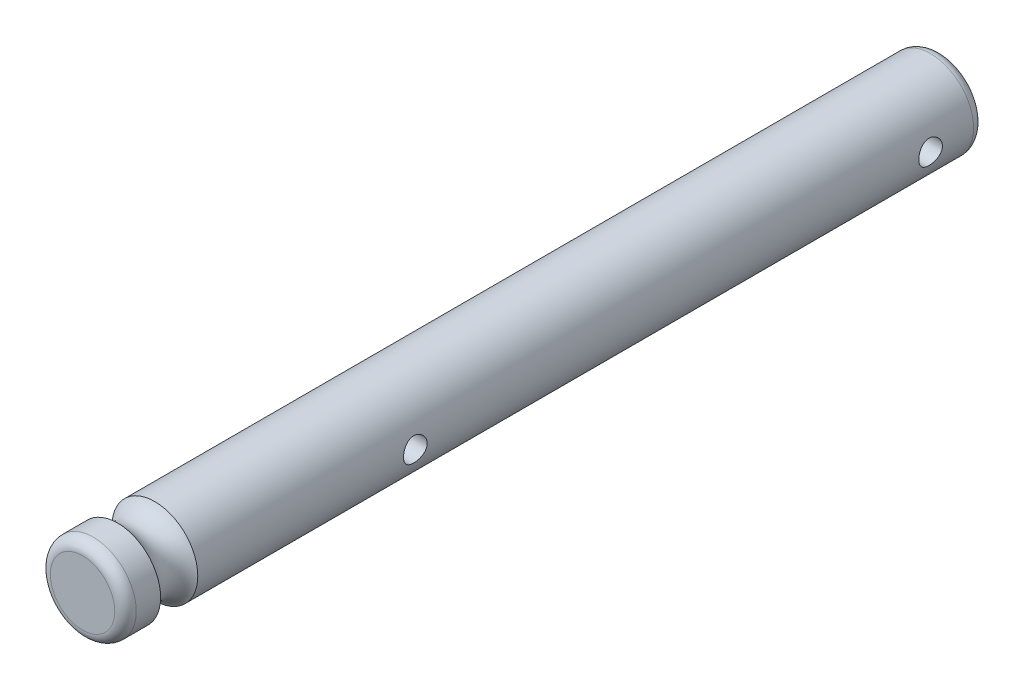
ISO-10303-21;
HEADER;
FILE_DESCRIPTION(('STEP AP214'),'2;1');
FILE_NAME('part.step','',(''),(''),'','','');
FILE_SCHEMA(('AUTOMOTIVE_DESIGN { 1 0 10303 214 1 1 1 1 }'));
ENDSEC;
DATA;
#1=APPLICATION_CONTEXT('core data for automotive mechanical design processes');
#2=APPLICATION_PROTOCOL_DEFINITION('international standard','automotive_design',2000,#1);
#3=PRODUCT_CONTEXT('',#1,'mechanical');
#4=PRODUCT('Part','Part','',(#3));
#5=PRODUCT_RELATED_PRODUCT_CATEGORY('part','',(#4));
#6=PRODUCT_DEFINITION_FORMATION('','',#4);
#7=PRODUCT_DEFINITION_CONTEXT('part definition',#1,'design');
#8=PRODUCT_DEFINITION('design','',#6,#7);
#9=PRODUCT_DEFINITION_SHAPE('','',#8);
#10=(LENGTH_UNIT() NAMED_UNIT(*) SI_UNIT(.MILLI.,.METRE.));
#11=(NAMED_UNIT(*) PLANE_ANGLE_UNIT() SI_UNIT($,.RADIAN.));
#12=(NAMED_UNIT(*) SI_UNIT($,.STERADIAN.) SOLID_ANGLE_UNIT());
#13=UNCERTAINTY_MEASURE_WITH_UNIT(LENGTH_MEASURE(1.E-05),#10,'distance_accuracy_value','');
#14=(GEOMETRIC_REPRESENTATION_CONTEXT(3) GLOBAL_UNCERTAINTY_ASSIGNED_CONTEXT((#13)) GLOBAL_UNIT_ASSIGNED_CONTEXT((#10,
#11,#12)) REPRESENTATION_CONTEXT('',''));
#15=CARTESIAN_POINT('',(0.,0.,0.));
#16=DIRECTION('',(0.,0.,1.));
#17=DIRECTION('',(1.,0.,0.));
#18=AXIS2_PLACEMENT_3D('',#15,#16,#17);
#19=CARTESIAN_POINT('',(27.8585649793968,100.826239149202,-35.));
#20=DIRECTION('',(0.,0.,1.));
#21=DIRECTION('',(1.,0.,0.));
#22=AXIS2_PLACEMENT_3D('',#19,#20,#21);
#23=CYLINDRICAL_SURFACE('',#22,2.00000000000001);
#24=CARTESIAN_POINT('',(29.8585649793968,100.826239149202,-33.05));
#25=CARTESIAN_POINT('',(29.8585645604243,100.795954573092,-33.0499993569988));
#26=CARTESIAN_POINT('',(29.8578703886983,100.76566323801,-33.0474902997092));
#27=CARTESIAN_POINT('',(29.8551687048102,100.70595547835,-33.0375395672689));
#28=CARTESIAN_POINT('',(29.8531606188829,100.67653944187,-33.0300957371639));
#29=CARTESIAN_POINT('',(29.8480523639191,100.619452590702,-33.0105375045117));
#30=CARTESIAN_POINT('',(29.8449536529947,100.591779503727,-32.9984293359243));
#31=CARTESIAN_POINT('',(29.8379903160867,100.538856638443,-32.9699098422794));
#32=CARTESIAN_POINT('',(29.8341256263541,100.513607062092,-32.953498159024));
#33=CARTESIAN_POINT('',(29.8259403946274,100.465628693265,-32.9164127066578));
#34=CARTESIAN_POINT('',(29.8216116771642,100.442967798031,-32.8956529014013));
#35=CARTESIAN_POINT('',(29.8130378387579,100.401401275133,-32.8506442780999));
#36=CARTESIAN_POINT('',(29.8087927293885,100.382496164129,-32.8263949808169));
#37=CARTESIAN_POINT('',(29.8007824624746,100.348640588242,-32.7745460009397));
#38=CARTESIAN_POINT('',(29.7970275841406,100.333769368836,-32.7468928391006));
#39=CARTESIAN_POINT('',(29.7905436096826,100.308914570641,-32.6893586398387));
#40=CARTESIAN_POINT('',(29.7878143110168,100.298930026663,-32.6594780437104));
#41=CARTESIAN_POINT('',(29.7837751159642,100.284369982522,-32.5990917787463));
#42=CARTESIAN_POINT('',(29.7824328435651,100.279670866244,-32.5686181352487));
#43=CARTESIAN_POINT('',(29.7812230425863,100.275429513646,-32.5072877546191));
#44=CARTESIAN_POINT('',(29.7813552193843,100.275886247091,-32.4764310952517));
#45=CARTESIAN_POINT('',(29.7830504733478,100.281845742991,-32.4161848504277));
#46=CARTESIAN_POINT('',(29.784570783309,100.287197696467,-32.3867789504433));
#47=CARTESIAN_POINT('',(29.788802354568,100.302553663525,-32.3292994857141));
#48=CARTESIAN_POINT('',(29.7915137164188,100.312558069888,-32.3012260336815));
#49=CARTESIAN_POINT('',(29.7978586483491,100.337054957856,-32.2468211178334));
#50=CARTESIAN_POINT('',(29.8015027920903,100.351599348278,-32.2205143123559));
#51=CARTESIAN_POINT('',(29.8092971466713,100.38472716848,-32.1706623034433));
#52=CARTESIAN_POINT('',(29.8134474627111,100.403311438515,-32.1471176760854));
#53=CARTESIAN_POINT('',(29.8219634582883,100.444757289656,-32.1025981706676));
#54=CARTESIAN_POINT('',(29.8263316073831,100.467745169934,-32.0817411699707));
#55=CARTESIAN_POINT('',(29.8346619992604,100.516946091156,-32.0441533027626));
#56=CARTESIAN_POINT('',(29.8386242239663,100.543159275616,-32.0274226199581));
#57=CARTESIAN_POINT('',(29.8457233264711,100.598256806728,-31.9985058061159));
#58=CARTESIAN_POINT('',(29.8488560997433,100.627153515397,-31.9863421554342));
#59=CARTESIAN_POINT('',(29.853913704232,100.686687771854,-31.9670801002347));
#60=CARTESIAN_POINT('',(29.855838816729,100.717324912457,-31.9599805161745));
#61=CARTESIAN_POINT('',(29.858221181629,100.778465313779,-31.9512358695023));
#62=CARTESIAN_POINT('',(29.8587215143572,100.808944027136,-31.9494306712223));
#63=CARTESIAN_POINT('',(29.8583224101686,100.869769110734,-31.9508822218042));
#64=CARTESIAN_POINT('',(29.8574231278542,100.900115495221,-31.9541384115822));
#65=CARTESIAN_POINT('',(29.8543537658011,100.959235072604,-31.9654893538275));
#66=CARTESIAN_POINT('',(29.852207427647,100.988026957161,-31.9734937672617));
#67=CARTESIAN_POINT('',(29.8468884186191,101.043855705072,-31.9940081316403));
#68=CARTESIAN_POINT('',(29.8437156330964,101.070892371972,-32.0065185859038));
#69=CARTESIAN_POINT('',(29.8365959717728,101.123057581174,-32.0359800722165));
#70=CARTESIAN_POINT('',(29.8326345616912,101.148135650416,-32.0530168712308));
#71=CARTESIAN_POINT('',(29.8243950099891,101.195132804906,-32.0909405134405));
#72=CARTESIAN_POINT('',(29.8201168018213,101.217051223564,-32.1118281669363));
#73=CARTESIAN_POINT('',(29.8115656168823,101.257789201605,-32.1576094841678));
#74=CARTESIAN_POINT('',(29.8072966815178,101.276495495204,-32.1826048863568));
#75=CARTESIAN_POINT('',(29.7993879401103,101.309451884168,-32.2354711711121));
#76=CARTESIAN_POINT('',(29.7957481093724,101.323702154468,-32.2633419407401));
#77=CARTESIAN_POINT('',(29.7895520182631,101.347235538571,-32.3210374433948));
#78=CARTESIAN_POINT('',(29.786989684344,101.356546573433,-32.3508500996102));
#79=CARTESIAN_POINT('',(29.7832405715183,101.369997879875,-32.4117011791542));
#80=CARTESIAN_POINT('',(29.7820534135401,101.374139576425,-32.4427392622494));
#81=CARTESIAN_POINT('',(29.7812221377033,101.377048921702,-32.5039966276044));
#82=CARTESIAN_POINT('',(29.7815255801096,101.3759991971,-32.5342066502851));
#83=CARTESIAN_POINT('',(29.7835177406294,101.368982082012,-32.5940011386669));
#84=CARTESIAN_POINT('',(29.7852064186982,101.363014833684,-32.6235856224259));
#85=CARTESIAN_POINT('',(29.7897465727514,101.346440981059,-32.6810429924494));
#86=CARTESIAN_POINT('',(29.792587754195,101.33587539127,-32.7089285808857));
#87=CARTESIAN_POINT('',(29.7991124722433,101.310436515739,-32.762552869996));
#88=CARTESIAN_POINT('',(29.802796148463,101.295562515914,-32.788291213871));
#89=CARTESIAN_POINT('',(29.8107340710321,101.261385375438,-32.8377563910182));
#90=CARTESIAN_POINT('',(29.8150025137297,101.241958725887,-32.8613956183433));
#91=CARTESIAN_POINT('',(29.8235523952465,101.199459595382,-32.9051379037078));
#92=CARTESIAN_POINT('',(29.8278338370113,101.176386216417,-32.9252400881648));
#93=CARTESIAN_POINT('',(29.8360461186021,101.126603232618,-32.9617975308598));
#94=CARTESIAN_POINT('',(29.8399665269871,101.099821718909,-32.9781574187032));
#95=CARTESIAN_POINT('',(29.8468985239938,101.043781106748,-33.0061172889043));
#96=CARTESIAN_POINT('',(29.8499106587859,101.014523510843,-33.0177201333206));
#97=CARTESIAN_POINT('',(29.8543269709555,100.958879035449,-33.0344345441717));
#98=CARTESIAN_POINT('',(29.8559042828902,100.932717454718,-33.0402575159838));
#99=CARTESIAN_POINT('',(29.8580234138745,100.879785347493,-33.0480403100829));
#100=CARTESIAN_POINT('',(29.8585653498262,100.853014890091,-33.0500005685017));
#101=CARTESIAN_POINT('',(29.8585649793968,100.826239149202,-33.05));
#102=B_SPLINE_CURVE_WITH_KNOTS('',3,(#24,#25,#26,#27,#28,#29,#30,#31,#32,#33,#34,#35,#36,#37,
#38,#39,#40,#41,#42,#43,#44,#45,#46,#47,#48,#49,#50,#51,#52,#53,#54,#55,#56,#57,#58,#59,#60,#61,
#62,#63,#64,#65,#66,#67,#68,#69,#70,#71,#72,#73,#74,#75,#76,#77,#78,#79,#80,#81,#82,#83,#84,#85,
#86,#87,#88,#89,#90,#91,#92,#93,#94,#95,#96,#97,#98,#99,#100,#101),.UNSPECIFIED.,.T.,.F.,(4,2,2,
2,2,2,2,2,2,2,2,2,2,2,2,2,2,2,2,2,2,2,2,2,2,2,2,2,2,2,2,2,2,2,2,2,2,2,4),(0.,0.0907554970783476,
0.181550652091401,0.27222487666387,0.362906650795225,0.455588894914306,0.548283879948796,
0.642686036748859,0.737069540250021,0.82919645051207,0.92130495244489,1.01066804517975,
1.10003868373032,1.19047109696404,1.28092233729235,1.37451991807268,1.46812166513554,
1.56217829008979,1.65621299984109,1.74737258741524,1.83852210616343,1.92799066743914,
2.01746922534481,2.10878192599123,2.20011386271805,2.29419761506475,2.3882776734132,
2.48182008008207,2.57533669535598,2.66558742847859,2.75583555270986,2.84529470451548,
2.93476869190233,3.02702912315808,3.11931230909951,3.21373529427193,3.30810138652267,
3.38835082055749,3.46859119325767),.UNSPECIFIED.);
#103=CARTESIAN_POINT('',(29.8585649793968,100.826239149202,-33.05));
#104=VERTEX_POINT('',#103);
#105=EDGE_CURVE('E10',#104,#104,#102,.T.);
#106=ORIENTED_EDGE('',*,*,#105,.T.);
#107=EDGE_LOOP('',(#106));
#108=FACE_BOUND('',#107,.T.);
#109=CARTESIAN_POINT('',(25.8585649793968,100.826239149202,-7.95000000000001));
#110=CARTESIAN_POINT('',(25.8585653983692,100.795954573092,-7.95000064300119));
#111=CARTESIAN_POINT('',(25.8592595700952,100.76566323801,-7.95250970029084));
#112=CARTESIAN_POINT('',(25.8619612539833,100.70595547835,-7.96246043273112));
#113=CARTESIAN_POINT('',(25.8639693399106,100.67653944187,-7.96990426283615));
#114=CARTESIAN_POINT('',(25.8690775948745,100.619452590702,-7.98946249548831));
#115=CARTESIAN_POINT('',(25.8721763057988,100.591779503727,-8.00157066407567));
#116=CARTESIAN_POINT('',(25.8791396427069,100.538856638443,-8.03009015772056));
#117=CARTESIAN_POINT('',(25.8830043324394,100.513607062092,-8.04650184097604));
#118=CARTESIAN_POINT('',(25.8911895641662,100.465628693265,-8.08358729334222));
#119=CARTESIAN_POINT('',(25.8955182816293,100.442967798031,-8.1043470985987));
#120=CARTESIAN_POINT('',(25.9040921200356,100.401401275133,-8.14935572190011));
#121=CARTESIAN_POINT('',(25.908337229405,100.382496164129,-8.17360501918309));
#122=CARTESIAN_POINT('',(25.9163474963189,100.348640588242,-8.22545399906028));
#123=CARTESIAN_POINT('',(25.9201023746529,100.333769368836,-8.25310716089938));
#124=CARTESIAN_POINT('',(25.9265863491109,100.308914570641,-8.3106413601613));
#125=CARTESIAN_POINT('',(25.9293156477767,100.298930026663,-8.34052195628963));
#126=CARTESIAN_POINT('',(25.9333548428293,100.284369982522,-8.4009082212537));
#127=CARTESIAN_POINT('',(25.9346971152284,100.279670866244,-8.43138186475129));
#128=CARTESIAN_POINT('',(25.9359069162073,100.275429513646,-8.49271224538086));
#129=CARTESIAN_POINT('',(25.9357747394092,100.275886247091,-8.52356890474832));
#130=CARTESIAN_POINT('',(25.9340794854457,100.281845742991,-8.58381514957226));
#131=CARTESIAN_POINT('',(25.9325591754845,100.287197696467,-8.61322104955674));
#132=CARTESIAN_POINT('',(25.9283276042255,100.302553663525,-8.67070051428585));
#133=CARTESIAN_POINT('',(25.9256162423747,100.312558069888,-8.69877396631849));
#134=CARTESIAN_POINT('',(25.9192713104444,100.337054957856,-8.75317888216658));
#135=CARTESIAN_POINT('',(25.9156271667032,100.351599348278,-8.77948568764408));
#136=CARTESIAN_POINT('',(25.9078328121223,100.38472716848,-8.8293376965567));
#137=CARTESIAN_POINT('',(25.9036824960824,100.403311438515,-8.85288232391458));
#138=CARTESIAN_POINT('',(25.8951665005052,100.444757289656,-8.89740182933243));
#139=CARTESIAN_POINT('',(25.8907983514105,100.467745169934,-8.91825883002931));
#140=CARTESIAN_POINT('',(25.8824679595331,100.516946091156,-8.95584669723742));
#141=CARTESIAN_POINT('',(25.8785057348272,100.543159275616,-8.97257738004188));
#142=CARTESIAN_POINT('',(25.8714066323224,100.598256806728,-9.00149419388407));
#143=CARTESIAN_POINT('',(25.8682738590502,100.627153515397,-9.01365784456584));
#144=CARTESIAN_POINT('',(25.8632162545616,100.686687771854,-9.0329198997653));
#145=CARTESIAN_POINT('',(25.8612911420645,100.717324912457,-9.04001948382549));
#146=CARTESIAN_POINT('',(25.8589087771645,100.778465313779,-9.04876413049769));
#147=CARTESIAN_POINT('',(25.8584084444363,100.808944027136,-9.05056932877772));
#148=CARTESIAN_POINT('',(25.8588075486249,100.869769110734,-9.04911777819582));
#149=CARTESIAN_POINT('',(25.8597068309393,100.900115495221,-9.04586158841777));
#150=CARTESIAN_POINT('',(25.8627761929924,100.959235072604,-9.03451064617249));
#151=CARTESIAN_POINT('',(25.8649225311466,100.988026957161,-9.02650623273827));
#152=CARTESIAN_POINT('',(25.8702415401744,101.043855705072,-9.00599186835974));
#153=CARTESIAN_POINT('',(25.8734143256971,101.070892371972,-8.99348141409616));
#154=CARTESIAN_POINT('',(25.8805339870207,101.123057581174,-8.96401992778347));
#155=CARTESIAN_POINT('',(25.8844953971023,101.148135650416,-8.9469831287692));
#156=CARTESIAN_POINT('',(25.8927349488044,101.195132804906,-8.90905948655953));
#157=CARTESIAN_POINT('',(25.8970131569723,101.217051223564,-8.88817183306368));
#158=CARTESIAN_POINT('',(25.9055643419112,101.257789201605,-8.84239051583222));
#159=CARTESIAN_POINT('',(25.9098332772757,101.276495495204,-8.81739511364318));
#160=CARTESIAN_POINT('',(25.9177420186832,101.309451884168,-8.76452882888795));
#161=CARTESIAN_POINT('',(25.9213818494212,101.323702154468,-8.7366580592599));
#162=CARTESIAN_POINT('',(25.9275779405304,101.347235538571,-8.67896255660515));
#163=CARTESIAN_POINT('',(25.9301402744495,101.356546573433,-8.64914990038979));
#164=CARTESIAN_POINT('',(25.9338893872753,101.369997879875,-8.58829882084583));
#165=CARTESIAN_POINT('',(25.9350765452534,101.374139576425,-8.55726073775058));
#166=CARTESIAN_POINT('',(25.9359078210902,101.377048921702,-8.49600337239558));
#167=CARTESIAN_POINT('',(25.935604378684,101.3759991971,-8.46579334971494));
#168=CARTESIAN_POINT('',(25.9336122181642,101.368982082012,-8.4059988613331));
#169=CARTESIAN_POINT('',(25.9319235400953,101.363014833684,-8.37641437757408));
#170=CARTESIAN_POINT('',(25.9273833860421,101.346440981059,-8.31895700755059));
#171=CARTESIAN_POINT('',(25.9245422045985,101.33587539127,-8.29107141911426));
#172=CARTESIAN_POINT('',(25.9180174865502,101.310436515739,-8.23744713000397));
#173=CARTESIAN_POINT('',(25.9143338103305,101.295562515914,-8.21170878612898));
#174=CARTESIAN_POINT('',(25.9063958877614,101.261385375438,-8.16224360898178));
#175=CARTESIAN_POINT('',(25.9021274450638,101.241958725887,-8.13860438165666));
#176=CARTESIAN_POINT('',(25.893577563547,101.199459595382,-8.0948620962922));
#177=CARTESIAN_POINT('',(25.8892961217822,101.176386216417,-8.07475991183524));
#178=CARTESIAN_POINT('',(25.8810838401914,101.126603232618,-8.03820246914019));
#179=CARTESIAN_POINT('',(25.8771634318065,101.099821718909,-8.02184258129678));
#180=CARTESIAN_POINT('',(25.8702314347997,101.043781106748,-7.9938827110957));
#181=CARTESIAN_POINT('',(25.8672193000077,101.014523510843,-7.98227986667943));
#182=CARTESIAN_POINT('',(25.862802987838,100.958879035449,-7.96556545582835));
#183=CARTESIAN_POINT('',(25.8612256759033,100.932717454718,-7.9597424840162));
#184=CARTESIAN_POINT('',(25.8591065449191,100.879785347493,-7.9519596899171));
#185=CARTESIAN_POINT('',(25.8585646089673,100.853014890091,-7.9499994314983));
#186=CARTESIAN_POINT('',(25.8585649793968,100.826239149202,-7.95000000000001));
#187=B_SPLINE_CURVE_WITH_KNOTS('',3,(#109,#110,#111,#112,#113,#114,#115,#116,#117,#118,#119,
#120,#121,#122,#123,#124,#125,#126,#127,#128,#129,#130,#131,#132,#133,#134,#135,#136,#137,#138,
#139,#140,#141,#142,#143,#144,#145,#146,#147,#148,#149,#150,#151,#152,#153,#154,#155,#156,#157,
#158,#159,#160,#161,#162,#163,#164,#165,#166,#167,#168,#169,#170,#171,#172,#173,#174,#175,#176,
#177,#178,#179,#180,#181,#182,#183,#184,#185,#186),.UNSPECIFIED.,.T.,.F.,(4,2,2,2,2,2,2,2,2,2,2,
2,2,2,2,2,2,2,2,2,2,2,2,2,2,2,2,2,2,2,2,2,2,2,2,2,2,2,4),(0.,0.0907554970783476,
0.181550652091401,0.272224876663839,0.362906650795224,0.455588894914305,0.548283879948798,
0.642686036748859,0.737069540250018,0.82919645051206,0.92130495244487,1.01066804517974,
1.10003868373031,1.19047109696403,1.28092233729234,1.37451991807267,1.46812166513554,
1.56217829008979,1.65621299984107,1.74737258741523,1.83852210616341,1.92799066743911,
2.01746922534479,2.10878192599122,2.20011386271804,2.29419761506473,2.38827767341318,
2.48182008008207,2.57533669535597,2.66558742847858,2.75583555270984,2.84529470451545,
2.9347686919023,3.02702912315808,3.11931230909949,3.21373529427192,3.30810138652265,
3.38835082055747,3.46859119325765),.UNSPECIFIED.);
#188=CARTESIAN_POINT('',(25.8585649793968,100.826239149202,-7.95000000000001));
#189=VERTEX_POINT('',#188);
#190=EDGE_CURVE('E56',#189,#189,#187,.T.);
#191=ORIENTED_EDGE('',*,*,#190,.T.);
#192=EDGE_LOOP('',(#191));
#193=FACE_BOUND('',#192,.T.);
#194=CARTESIAN_POINT('',(27.8585649793968,100.826239149202,-34.5));
#195=DIRECTION('',(0.,0.,1.));
#196=DIRECTION('',(1.,0.,0.));
#197=AXIS2_PLACEMENT_3D('',#194,#195,#196);
#198=CIRCLE('',#197,2.00000000000001);
#199=CARTESIAN_POINT('',(29.8585649793968,100.826239149202,-34.5));
#200=VERTEX_POINT('',#199);
#201=EDGE_CURVE('E83',#200,#200,#198,.T.);
#202=ORIENTED_EDGE('',*,*,#201,.T.);
#203=EDGE_LOOP('',(#202));
#204=FACE_BOUND('',#203,.T.);
#205=CARTESIAN_POINT('',(27.8585649793968,100.826239149202,1.63397459621555));
#206=DIRECTION('',(0.,0.,1.));
#207=DIRECTION('',(1.,0.,0.));
#208=AXIS2_PLACEMENT_3D('',#205,#206,#207);
#209=CIRCLE('',#208,2.00000000000001);
#210=CARTESIAN_POINT('',(29.8585649793968,100.826239149202,1.63397459621555));
#211=VERTEX_POINT('',#210);
#212=EDGE_CURVE('E92',#211,#211,#209,.T.);
#213=ORIENTED_EDGE('',*,*,#212,.F.);
#214=EDGE_LOOP('',(#213));
#215=FACE_BOUND('',#214,.T.);
#216=CARTESIAN_POINT('',(29.8585649793968,100.826239149202,-9.04999999999998));
#217=CARTESIAN_POINT('',(29.8585645604243,100.795954573092,-9.0499993569988));
#218=CARTESIAN_POINT('',(29.8578703886983,100.76566323801,-9.04749029970916));
#219=CARTESIAN_POINT('',(29.8551687048102,100.70595547835,-9.03753956726888));
#220=CARTESIAN_POINT('',(29.8531606188829,100.67653944187,-9.03009573716385));
#221=CARTESIAN_POINT('',(29.8480523639191,100.619452590702,-9.01053750451169));
#222=CARTESIAN_POINT('',(29.8449536529947,100.591779503727,-8.99842933592432));
#223=CARTESIAN_POINT('',(29.8379903160867,100.538856638443,-8.96990984227944));
#224=CARTESIAN_POINT('',(29.8341256263541,100.513607062092,-8.95349815902396));
#225=CARTESIAN_POINT('',(29.8259403946274,100.465628693265,-8.91641270665778));
#226=CARTESIAN_POINT('',(29.8216116771642,100.442967798031,-8.8956529014013));
#227=CARTESIAN_POINT('',(29.8130378387579,100.401401275133,-8.85064427809989));
#228=CARTESIAN_POINT('',(29.8087927293885,100.382496164129,-8.82639498081691));
#229=CARTESIAN_POINT('',(29.8007824624746,100.348640588242,-8.77454600093972));
#230=CARTESIAN_POINT('',(29.7970275841406,100.333769368836,-8.74689283910062));
#231=CARTESIAN_POINT('',(29.7905436096826,100.308914570641,-8.6893586398387));
#232=CARTESIAN_POINT('',(29.7878143110168,100.298930026663,-8.65947804371037));
#233=CARTESIAN_POINT('',(29.7837751159642,100.284369982522,-8.5990917787463));
#234=CARTESIAN_POINT('',(29.7824328435651,100.279670866244,-8.56861813524871));
#235=CARTESIAN_POINT('',(29.7812230425863,100.275429513646,-8.50728775461915));
#236=CARTESIAN_POINT('',(29.7813552193843,100.275886247091,-8.47643109525168));
#237=CARTESIAN_POINT('',(29.7830504733478,100.281845742991,-8.41618485042774));
#238=CARTESIAN_POINT('',(29.784570783309,100.287197696467,-8.38677895044326));
#239=CARTESIAN_POINT('',(29.788802354568,100.302553663525,-8.32929948571415));
#240=CARTESIAN_POINT('',(29.7915137164188,100.312558069888,-8.30122603368151));
#241=CARTESIAN_POINT('',(29.7978586483491,100.337054957856,-8.24682111783342));
#242=CARTESIAN_POINT('',(29.8015027920903,100.351599348278,-8.22051431235593));
#243=CARTESIAN_POINT('',(29.8092971466713,100.38472716848,-8.17066230344331));
#244=CARTESIAN_POINT('',(29.8134474627111,100.403311438515,-8.14711767608543));
#245=CARTESIAN_POINT('',(29.8219634582883,100.444757289656,-8.10259817066757));
#246=CARTESIAN_POINT('',(29.8263316073831,100.467745169934,-8.08174116997069));
#247=CARTESIAN_POINT('',(29.8346619992604,100.516946091156,-8.04415330276258));
#248=CARTESIAN_POINT('',(29.8386242239663,100.543159275616,-8.02742261995812));
#249=CARTESIAN_POINT('',(29.8457233264711,100.598256806728,-7.99850580611593));
#250=CARTESIAN_POINT('',(29.8488560997433,100.627153515397,-7.98634215543416));
#251=CARTESIAN_POINT('',(29.853913704232,100.686687771854,-7.9670801002347));
#252=CARTESIAN_POINT('',(29.855838816729,100.717324912457,-7.95998051617451));
#253=CARTESIAN_POINT('',(29.858221181629,100.778465313779,-7.95123586950231));
#254=CARTESIAN_POINT('',(29.8587215143572,100.808944027136,-7.94943067122228));
#255=CARTESIAN_POINT('',(29.8583224101686,100.869769110734,-7.95088222180419));
#256=CARTESIAN_POINT('',(29.8574231278542,100.900115495221,-7.95413841158223));
#257=CARTESIAN_POINT('',(29.8543537658011,100.959235072604,-7.96548935382751));
#258=CARTESIAN_POINT('',(29.852207427647,100.988026957161,-7.97349376726173));
#259=CARTESIAN_POINT('',(29.8468884186191,101.043855705072,-7.99400813164026));
#260=CARTESIAN_POINT('',(29.8437156330964,101.070892371972,-8.00651858590384));
#261=CARTESIAN_POINT('',(29.8365959717728,101.123057581174,-8.03598007221653));
#262=CARTESIAN_POINT('',(29.8326345616912,101.148135650416,-8.0530168712308));
#263=CARTESIAN_POINT('',(29.8243950099891,101.195132804906,-8.09094051344047));
#264=CARTESIAN_POINT('',(29.8201168018213,101.217051223564,-8.11182816693631));
#265=CARTESIAN_POINT('',(29.8115656168823,101.257789201605,-8.15760948416779));
#266=CARTESIAN_POINT('',(29.8072966815178,101.276495495204,-8.18260488635682));
#267=CARTESIAN_POINT('',(29.7993879401103,101.309451884168,-8.23547117111205));
#268=CARTESIAN_POINT('',(29.7957481093724,101.323702154468,-8.2633419407401));
#269=CARTESIAN_POINT('',(29.7895520182631,101.347235538571,-8.32103744339485));
#270=CARTESIAN_POINT('',(29.786989684344,101.356546573433,-8.35085009961021));
#271=CARTESIAN_POINT('',(29.7832405715183,101.369997879875,-8.41170117915417));
#272=CARTESIAN_POINT('',(29.7820534135401,101.374139576425,-8.44273926224942));
#273=CARTESIAN_POINT('',(29.7812221377033,101.377048921702,-8.50399662760442));
#274=CARTESIAN_POINT('',(29.7815255801096,101.3759991971,-8.53420665028506));
#275=CARTESIAN_POINT('',(29.7835177406294,101.368982082012,-8.5940011386669));
#276=CARTESIAN_POINT('',(29.7852064186983,101.363014833684,-8.62358562242593));
#277=CARTESIAN_POINT('',(29.7897465727514,101.346440981059,-8.68104299244942));
#278=CARTESIAN_POINT('',(29.792587754195,101.33587539127,-8.70892858088574));
#279=CARTESIAN_POINT('',(29.7991124722433,101.310436515739,-8.76255286999603));
#280=CARTESIAN_POINT('',(29.802796148463,101.295562515914,-8.78829121387102));
#281=CARTESIAN_POINT('',(29.8107340710321,101.261385375438,-8.83775639101822));
#282=CARTESIAN_POINT('',(29.8150025137297,101.241958725887,-8.86139561834334));
#283=CARTESIAN_POINT('',(29.8235523952465,101.199459595382,-8.9051379037078));
#284=CARTESIAN_POINT('',(29.8278338370113,101.176386216417,-8.92524008816476));
#285=CARTESIAN_POINT('',(29.8360461186021,101.126603232618,-8.96179753085981));
#286=CARTESIAN_POINT('',(29.8399665269871,101.099821718909,-8.97815741870322));
#287=CARTESIAN_POINT('',(29.8468985239938,101.043781106748,-9.0061172889043));
#288=CARTESIAN_POINT('',(29.8499106587859,101.014523510843,-9.01772013332057));
#289=CARTESIAN_POINT('',(29.8543269709555,100.958879035449,-9.03443454417165));
#290=CARTESIAN_POINT('',(29.8559042828902,100.932717454718,-9.0402575159838));
#291=CARTESIAN_POINT('',(29.8580234138745,100.879785347493,-9.0480403100829));
#292=CARTESIAN_POINT('',(29.8585653498262,100.853014890091,-9.05000056850169));
#293=CARTESIAN_POINT('',(29.8585649793968,100.826239149202,-9.04999999999998));
#294=B_SPLINE_CURVE_WITH_KNOTS('',3,(#216,#217,#218,#219,#220,#221,#222,#223,#224,#225,#226,
#227,#228,#229,#230,#231,#232,#233,#234,#235,#236,#237,#238,#239,#240,#241,#242,#243,#244,#245,
#246,#247,#248,#249,#250,#251,#252,#253,#254,#255,#256,#257,#258,#259,#260,#261,#262,#263,#264,
#265,#266,#267,#268,#269,#270,#271,#272,#273,#274,#275,#276,#277,#278,#279,#280,#281,#282,#283,
#284,#285,#286,#287,#288,#289,#290,#291,#292,#293),.UNSPECIFIED.,.T.,.F.,(4,2,2,2,2,2,2,2,2,2,2,
2,2,2,2,2,2,2,2,2,2,2,2,2,2,2,2,2,2,2,2,2,2,2,2,2,2,2,4),(0.,0.090755497078347,
0.181550652091401,0.272224876663869,0.362906650795224,0.455588894914306,0.548283879948798,
0.642686036748859,0.737069540250018,0.829196450512058,0.92130495244487,1.01066804517974,
1.10003868373031,1.19047109696402,1.28092233729234,1.37451991807267,1.46812166513554,
1.56217829008979,1.65621299984107,1.74737258741523,1.83852210616341,1.92799066743911,
2.01746922534479,2.10878192599121,2.20011386271804,2.29419761506473,2.38827767341318,
2.48182008008207,2.57533669535597,2.66558742847857,2.75583555270984,2.84529470451545,
2.9347686919023,3.02702912315808,3.11931230909949,3.21373529427192,3.30810138652265,
3.38835082055747,3.46859119325765),.UNSPECIFIED.);
#295=CARTESIAN_POINT('',(29.8585649793968,100.826239149202,-9.04999999999998));
#296=VERTEX_POINT('',#295);
#297=EDGE_CURVE('E46',#296,#296,#294,.T.);
#298=ORIENTED_EDGE('',*,*,#297,.T.);
#299=EDGE_LOOP('',(#298));
#300=FACE_BOUND('',#299,.T.);
#301=CARTESIAN_POINT('',(25.8585649793968,100.826239149202,-31.95));
#302=CARTESIAN_POINT('',(25.8585653983692,100.795954573092,-31.9500006430012));
#303=CARTESIAN_POINT('',(25.8592595700952,100.76566323801,-31.9525097002908));
#304=CARTESIAN_POINT('',(25.8619612539833,100.70595547835,-31.9624604327311));
#305=CARTESIAN_POINT('',(25.8639693399106,100.67653944187,-31.9699042628361));
#306=CARTESIAN_POINT('',(25.8690775948745,100.619452590702,-31.9894624954883));
#307=CARTESIAN_POINT('',(25.8721763057988,100.591779503727,-32.0015706640757));
#308=CARTESIAN_POINT('',(25.8791396427069,100.538856638443,-32.0300901577206));
#309=CARTESIAN_POINT('',(25.8830043324394,100.513607062092,-32.046501840976));
#310=CARTESIAN_POINT('',(25.8911895641662,100.465628693265,-32.0835872933422));
#311=CARTESIAN_POINT('',(25.8955182816293,100.442967798031,-32.1043470985987));
#312=CARTESIAN_POINT('',(25.9040921200356,100.401401275133,-32.1493557219001));
#313=CARTESIAN_POINT('',(25.908337229405,100.382496164129,-32.1736050191831));
#314=CARTESIAN_POINT('',(25.9163474963189,100.348640588242,-32.2254539990603));
#315=CARTESIAN_POINT('',(25.9201023746529,100.333769368836,-32.2531071608994));
#316=CARTESIAN_POINT('',(25.9265863491109,100.308914570641,-32.3106413601613));
#317=CARTESIAN_POINT('',(25.9293156477767,100.298930026663,-32.3405219562896));
#318=CARTESIAN_POINT('',(25.9333548428293,100.284369982522,-32.4009082212537));
#319=CARTESIAN_POINT('',(25.9346971152284,100.279670866244,-32.4313818647513));
#320=CARTESIAN_POINT('',(25.9359069162073,100.275429513646,-32.4927122453809));
#321=CARTESIAN_POINT('',(25.9357747394092,100.275886247091,-32.5235689047483));
#322=CARTESIAN_POINT('',(25.9340794854457,100.281845742991,-32.5838151495723));
#323=CARTESIAN_POINT('',(25.9325591754845,100.287197696467,-32.6132210495567));
#324=CARTESIAN_POINT('',(25.9283276042255,100.302553663525,-32.6707005142859));
#325=CARTESIAN_POINT('',(25.9256162423747,100.312558069888,-32.6987739663185));
#326=CARTESIAN_POINT('',(25.9192713104444,100.337054957856,-32.7531788821666));
#327=CARTESIAN_POINT('',(25.9156271667032,100.351599348278,-32.7794856876441));
#328=CARTESIAN_POINT('',(25.9078328121223,100.38472716848,-32.8293376965567));
#329=CARTESIAN_POINT('',(25.9036824960824,100.403311438515,-32.8528823239146));
#330=CARTESIAN_POINT('',(25.8951665005052,100.444757289656,-32.8974018293324));
#331=CARTESIAN_POINT('',(25.8907983514105,100.467745169934,-32.9182588300293));
#332=CARTESIAN_POINT('',(25.8824679595331,100.516946091156,-32.9558466972374));
#333=CARTESIAN_POINT('',(25.8785057348272,100.543159275616,-32.9725773800419));
#334=CARTESIAN_POINT('',(25.8714066323224,100.598256806728,-33.0014941938841));
#335=CARTESIAN_POINT('',(25.8682738590502,100.627153515397,-33.0136578445658));
#336=CARTESIAN_POINT('',(25.8632162545616,100.686687771854,-33.0329198997653));
#337=CARTESIAN_POINT('',(25.8612911420645,100.717324912457,-33.0400194838255));
#338=CARTESIAN_POINT('',(25.8589087771645,100.778465313779,-33.0487641304977));
#339=CARTESIAN_POINT('',(25.8584084444363,100.808944027136,-33.0505693287777));
#340=CARTESIAN_POINT('',(25.8588075486249,100.869769110734,-33.0491177781958));
#341=CARTESIAN_POINT('',(25.8597068309393,100.900115495221,-33.0458615884178));
#342=CARTESIAN_POINT('',(25.8627761929924,100.959235072604,-33.0345106461725));
#343=CARTESIAN_POINT('',(25.8649225311466,100.988026957161,-33.0265062327383));
#344=CARTESIAN_POINT('',(25.8702415401744,101.043855705072,-33.0059918683597));
#345=CARTESIAN_POINT('',(25.8734143256971,101.070892371972,-32.9934814140962));
#346=CARTESIAN_POINT('',(25.8805339870207,101.123057581174,-32.9640199277835));
#347=CARTESIAN_POINT('',(25.8844953971023,101.148135650416,-32.9469831287692));
#348=CARTESIAN_POINT('',(25.8927349488044,101.195132804906,-32.9090594865595));
#349=CARTESIAN_POINT('',(25.8970131569723,101.217051223564,-32.8881718330637));
#350=CARTESIAN_POINT('',(25.9055643419112,101.257789201605,-32.8423905158322));
#351=CARTESIAN_POINT('',(25.9098332772757,101.276495495204,-32.8173951136432));
#352=CARTESIAN_POINT('',(25.9177420186832,101.309451884168,-32.764528828888));
#353=CARTESIAN_POINT('',(25.9213818494212,101.323702154468,-32.7366580592599));
#354=CARTESIAN_POINT('',(25.9275779405304,101.347235538571,-32.6789625566051));
#355=CARTESIAN_POINT('',(25.9301402744495,101.356546573433,-32.6491499003898));
#356=CARTESIAN_POINT('',(25.9338893872752,101.369997879875,-32.5882988208458));
#357=CARTESIAN_POINT('',(25.9350765452534,101.374139576425,-32.5572607377506));
#358=CARTESIAN_POINT('',(25.9359078210902,101.377048921702,-32.4960033723956));
#359=CARTESIAN_POINT('',(25.935604378684,101.3759991971,-32.4657933497149));
#360=CARTESIAN_POINT('',(25.9336122181642,101.368982082012,-32.4059988613331));
#361=CARTESIAN_POINT('',(25.9319235400953,101.363014833684,-32.3764143775741));
#362=CARTESIAN_POINT('',(25.9273833860421,101.346440981059,-32.3189570075506));
#363=CARTESIAN_POINT('',(25.9245422045985,101.33587539127,-32.2910714191143));
#364=CARTESIAN_POINT('',(25.9180174865502,101.310436515739,-32.237447130004));
#365=CARTESIAN_POINT('',(25.9143338103305,101.295562515914,-32.211708786129));
#366=CARTESIAN_POINT('',(25.9063958877614,101.261385375438,-32.1622436089818));
#367=CARTESIAN_POINT('',(25.9021274450638,101.241958725887,-32.1386043816567));
#368=CARTESIAN_POINT('',(25.893577563547,101.199459595382,-32.0948620962922));
#369=CARTESIAN_POINT('',(25.8892961217822,101.176386216417,-32.0747599118352));
#370=CARTESIAN_POINT('',(25.8810838401914,101.126603232618,-32.0382024691402));
#371=CARTESIAN_POINT('',(25.8771634318065,101.099821718909,-32.0218425812968));
#372=CARTESIAN_POINT('',(25.8702314347997,101.043781106748,-31.9938827110957));
#373=CARTESIAN_POINT('',(25.8672193000077,101.014523510843,-31.9822798666794));
#374=CARTESIAN_POINT('',(25.862802987838,100.958879035449,-31.9655654558283));
#375=CARTESIAN_POINT('',(25.8612256759033,100.932717454718,-31.9597424840162));
#376=CARTESIAN_POINT('',(25.8591065449191,100.879785347493,-31.9519596899171));
#377=CARTESIAN_POINT('',(25.8585646089673,100.853014890091,-31.9499994314983));
#378=CARTESIAN_POINT('',(25.8585649793968,100.826239149202,-31.95));
#379=B_SPLINE_CURVE_WITH_KNOTS('',3,(#301,#302,#303,#304,#305,#306,#307,#308,#309,#310,#311,
#312,#313,#314,#315,#316,#317,#318,#319,#320,#321,#322,#323,#324,#325,#326,#327,#328,#329,#330,
#331,#332,#333,#334,#335,#336,#337,#338,#339,#340,#341,#342,#343,#344,#345,#346,#347,#348,#349,
#350,#351,#352,#353,#354,#355,#356,#357,#358,#359,#360,#361,#362,#363,#364,#365,#366,#367,#368,
#369,#370,#371,#372,#373,#374,#375,#376,#377,#378),.UNSPECIFIED.,.T.,.F.,(4,2,2,2,2,2,2,2,2,2,2,
2,2,2,2,2,2,2,2,2,2,2,2,2,2,2,2,2,2,2,2,2,2,2,2,2,2,2,4),(0.,0.0907554970783476,
0.181550652091401,0.27222487666387,0.362906650795225,0.455588894914301,0.548283879948797,
0.64268603674886,0.737069540250021,0.82919645051207,0.921304952444891,1.01066804517975,
1.10003868373032,1.19047109696404,1.28092233729235,1.37451991807267,1.46812166513554,
1.56217829008979,1.65621299984109,1.74737258741524,1.83852210616343,1.92799066743914,
2.01746922534481,2.10878192599123,2.20011386271805,2.29419761506476,2.3882776734132,
2.4818200800821,2.57533669535598,2.66558742847858,2.75583555270986,2.84529470451547,
2.93476869190233,3.02702912315808,3.11931230909951,3.21373529427192,3.30810138652267,
3.38835082055749,3.46859119325767),.UNSPECIFIED.);
#380=CARTESIAN_POINT('',(25.8585649793968,100.826239149202,-31.95));
#381=VERTEX_POINT('',#380);
#382=EDGE_CURVE('E37',#381,#381,#379,.T.);
#383=ORIENTED_EDGE('',*,*,#382,.T.);
#384=EDGE_LOOP('',(#383));
#385=FACE_BOUND('',#384,.T.);
#386=ADVANCED_FACE('F33',(#108,#193,#204,#215,#300,#385),#23,.T.);
#387=CARTESIAN_POINT('',(27.8585649793968,100.826239149202,-35.));
#388=DIRECTION('',(0.,0.,1.));
#389=DIRECTION('',(1.,0.,0.));
#390=AXIS2_PLACEMENT_3D('',#387,#388,#389);
#391=PLANE('',#390);
#392=CARTESIAN_POINT('',(27.8585649793968,100.826239149202,-35.));
#393=DIRECTION('',(0.,0.,1.));
#394=DIRECTION('',(1.,0.,0.));
#395=AXIS2_PLACEMENT_3D('',#392,#393,#394);
#396=CIRCLE('',#395,1.50000000000001);
#397=CARTESIAN_POINT('',(29.3585649793968,100.826239149202,-35.));
#398=VERTEX_POINT('',#397);
#399=EDGE_CURVE('E50',#398,#398,#396,.F.);
#400=ORIENTED_EDGE('',*,*,#399,.T.);
#401=EDGE_LOOP('',(#400));
#402=FACE_BOUND('',#401,.T.);
#403=ADVANCED_FACE('F110',(#402),#391,.F.);
#404=CARTESIAN_POINT('',(27.8585649793968,100.826239149202,2.5));
#405=DIRECTION('',(0.,0.,-1.));
#406=DIRECTION('',(-1.,0.,0.));
#407=AXIS2_PLACEMENT_3D('',#404,#405,#406);
#408=TOROIDAL_SURFACE('',#407,2.5,1.);
#409=ORIENTED_EDGE('',*,*,#212,.T.);
#410=EDGE_LOOP('',(#409));
#411=FACE_BOUND('',#410,.T.);
#412=CARTESIAN_POINT('',(27.8585649793968,100.826239149202,3.36602540378444));
#413=DIRECTION('',(0.,0.,-1.));
#414=DIRECTION('',(-1.,0.,0.));
#415=AXIS2_PLACEMENT_3D('',#412,#413,#414);
#416=CIRCLE('',#415,2.00000000000001);
#417=CARTESIAN_POINT('',(25.8585649793968,100.826239149202,3.36602540378444));
#418=VERTEX_POINT('',#417);
#419=EDGE_CURVE('E95',#418,#418,#416,.T.);
#420=ORIENTED_EDGE('',*,*,#419,.T.);
#421=EDGE_LOOP('',(#420));
#422=FACE_BOUND('',#421,.T.);
#423=ADVANCED_FACE('F74',(#411,#422),#408,.F.);
#424=CARTESIAN_POINT('',(27.8585649793968,100.826239149202,5.));
#425=DIRECTION('',(0.,0.,1.));
#426=DIRECTION('',(1.,0.,0.));
#427=AXIS2_PLACEMENT_3D('',#424,#425,#426);
#428=PLANE('',#427);
#429=CARTESIAN_POINT('',(27.8585649793968,100.826239149202,5.));
#430=DIRECTION('',(0.,0.,1.));
#431=DIRECTION('',(1.,0.,0.));
#432=AXIS2_PLACEMENT_3D('',#429,#430,#431);
#433=CIRCLE('',#432,1.50000000000001);
#434=CARTESIAN_POINT('',(29.3585649793968,100.826239149202,5.));
#435=VERTEX_POINT('',#434);
#436=EDGE_CURVE('E89',#435,#435,#433,.T.);
#437=ORIENTED_EDGE('',*,*,#436,.T.);
#438=EDGE_LOOP('',(#437));
#439=FACE_BOUND('',#438,.T.);
#440=ADVANCED_FACE('F117',(#439),#428,.T.);
#441=CARTESIAN_POINT('',(27.8585649793968,100.826239149202,4.5));
#442=DIRECTION('',(0.,0.,1.));
#443=DIRECTION('',(1.,0.,0.));
#444=AXIS2_PLACEMENT_3D('',#441,#442,#443);
#445=CIRCLE('',#444,2.00000000000001);
#446=CARTESIAN_POINT('',(29.8585649793968,100.826239149202,4.5));
#447=VERTEX_POINT('',#446);
#448=EDGE_CURVE('E86',#447,#447,#445,.F.);
#449=ORIENTED_EDGE('',*,*,#448,.T.);
#450=EDGE_LOOP('',(#449));
#451=FACE_BOUND('',#450,.T.);
#452=ORIENTED_EDGE('',*,*,#419,.F.);
#453=EDGE_LOOP('',(#452));
#454=FACE_BOUND('',#453,.T.);
#455=ADVANCED_FACE('F61',(#451,#454),#23,.T.);
#456=CARTESIAN_POINT('',(27.8585649793968,100.826239149202,4.5));
#457=DIRECTION('',(0.,0.,1.));
#458=DIRECTION('',(1.,0.,0.));
#459=AXIS2_PLACEMENT_3D('',#456,#457,#458);
#460=TOROIDAL_SURFACE('',#459,1.50000000000001,0.5);
#461=ORIENTED_EDGE('',*,*,#448,.F.);
#462=EDGE_LOOP('',(#461));
#463=FACE_BOUND('',#462,.T.);
#464=ORIENTED_EDGE('',*,*,#436,.F.);
#465=EDGE_LOOP('',(#464));
#466=FACE_BOUND('',#465,.T.);
#467=ADVANCED_FACE('F116',(#463,#466),#460,.T.);
#468=CARTESIAN_POINT('',(27.8585649793968,100.826239149202,-34.5));
#469=DIRECTION('',(0.,0.,1.));
#470=DIRECTION('',(1.,0.,0.));
#471=AXIS2_PLACEMENT_3D('',#468,#469,#470);
#472=TOROIDAL_SURFACE('',#471,1.50000000000001,0.5);
#473=ORIENTED_EDGE('',*,*,#399,.F.);
#474=EDGE_LOOP('',(#473));
#475=FACE_BOUND('',#474,.T.);
#476=ORIENTED_EDGE('',*,*,#201,.F.);
#477=EDGE_LOOP('',(#476));
#478=FACE_BOUND('',#477,.T.);
#479=ADVANCED_FACE('F35',(#475,#478),#472,.T.);
#480=CARTESIAN_POINT('',(25.8585649793968,100.826239149202,-8.5));
#481=DIRECTION('',(-1.,0.,0.));
#482=DIRECTION('',(0.,0.,1.));
#483=AXIS2_PLACEMENT_3D('',#480,#481,#482);
#484=CYLINDRICAL_SURFACE('',#483,0.549999999999991);
#485=ORIENTED_EDGE('',*,*,#190,.F.);
#486=EDGE_LOOP('',(#485));
#487=FACE_BOUND('',#486,.T.);
#488=ORIENTED_EDGE('',*,*,#297,.F.);
#489=EDGE_LOOP('',(#488));
#490=FACE_BOUND('',#489,.T.);
#491=ADVANCED_FACE('F67',(#487,#490),#484,.F.);
#492=CARTESIAN_POINT('',(25.8585649793968,100.826239149202,-32.5));
#493=DIRECTION('',(-1.,0.,0.));
#494=DIRECTION('',(0.,0.,1.));
#495=AXIS2_PLACEMENT_3D('',#492,#493,#494);
#496=CYLINDRICAL_SURFACE('',#495,0.549999999999995);
#497=ORIENTED_EDGE('',*,*,#382,.F.);
#498=EDGE_LOOP('',(#497));
#499=FACE_BOUND('',#498,.T.);
#500=ORIENTED_EDGE('',*,*,#105,.F.);
#501=EDGE_LOOP('',(#500));
#502=FACE_BOUND('',#501,.T.);
#503=ADVANCED_FACE('F64',(#499,#502),#496,.F.);
#504=CLOSED_SHELL('',(#386,#403,#423,#440,#455,#467,#479,#491,#503));
#505=MANIFOLD_SOLID_BREP('B2',#504);
#506=ADVANCED_BREP_SHAPE_REPRESENTATION('',(#18,#505),#14);
#507=SHAPE_DEFINITION_REPRESENTATION(#9,#506);
ENDSEC;
END-ISO-10303-21;
